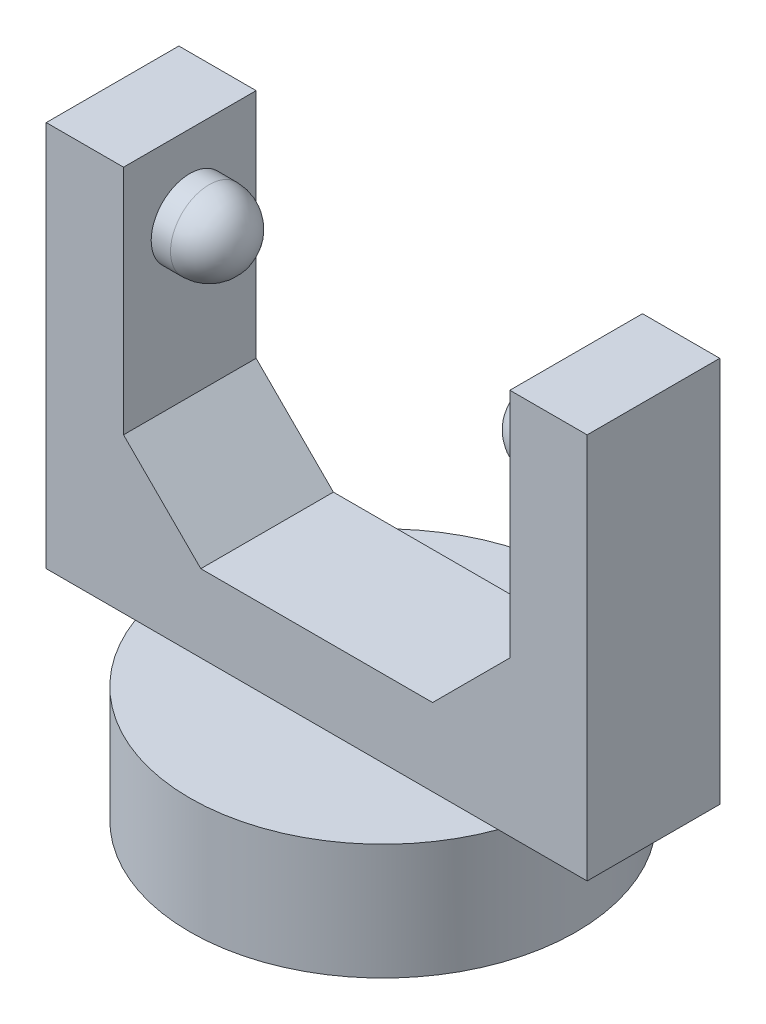
ISO-10303-21;
HEADER;
FILE_DESCRIPTION(('STEP AP214'),'2;1');
FILE_NAME('part.step','',(''),(''),'','','');
FILE_SCHEMA(('AUTOMOTIVE_DESIGN { 1 0 10303 214 1 1 1 1 }'));
ENDSEC;
DATA;
#1=APPLICATION_CONTEXT('core data for automotive mechanical design processes');
#2=APPLICATION_PROTOCOL_DEFINITION('international standard','automotive_design',2000,#1);
#3=PRODUCT_CONTEXT('',#1,'mechanical');
#4=PRODUCT('Part','Part','',(#3));
#5=PRODUCT_RELATED_PRODUCT_CATEGORY('part','',(#4));
#6=PRODUCT_DEFINITION_FORMATION('','',#4);
#7=PRODUCT_DEFINITION_CONTEXT('part definition',#1,'design');
#8=PRODUCT_DEFINITION('design','',#6,#7);
#9=PRODUCT_DEFINITION_SHAPE('','',#8);
#10=(LENGTH_UNIT() NAMED_UNIT(*) SI_UNIT(.MILLI.,.METRE.));
#11=(NAMED_UNIT(*) PLANE_ANGLE_UNIT() SI_UNIT($,.RADIAN.));
#12=(NAMED_UNIT(*) SI_UNIT($,.STERADIAN.) SOLID_ANGLE_UNIT());
#13=UNCERTAINTY_MEASURE_WITH_UNIT(LENGTH_MEASURE(1.E-05),#10,'distance_accuracy_value','');
#14=(GEOMETRIC_REPRESENTATION_CONTEXT(3) GLOBAL_UNCERTAINTY_ASSIGNED_CONTEXT((#13)) GLOBAL_UNIT_ASSIGNED_CONTEXT((#10,
#11,#12)) REPRESENTATION_CONTEXT('',''));
#15=CARTESIAN_POINT('',(0.,0.,0.));
#16=DIRECTION('',(0.,0.,1.));
#17=DIRECTION('',(1.,0.,0.));
#18=AXIS2_PLACEMENT_3D('',#15,#16,#17);
#19=CARTESIAN_POINT('',(0.,32.5,0.));
#20=DIRECTION('',(0.,1.,0.));
#21=DIRECTION('',(0.,0.,1.));
#22=AXIS2_PLACEMENT_3D('',#19,#20,#21);
#23=PLANE('',#22);
#24=DIRECTION('',(0.,0.,1.));
#25=VECTOR('',#24,1.);
#26=CARTESIAN_POINT('',(-12.5,32.5,-4.29038395748194));
#27=LINE('',#26,#25);
#28=CARTESIAN_POINT('',(-12.5,32.5,-4.29038395748194));
#29=VERTEX_POINT('',#28);
#30=CARTESIAN_POINT('',(-12.5,32.5,4.29038395748193));
#31=VERTEX_POINT('',#30);
#32=EDGE_CURVE('E141',#29,#31,#27,.T.);
#33=ORIENTED_EDGE('',*,*,#32,.F.);
#34=DIRECTION('',(-1.,0.,0.));
#35=VECTOR('',#34,1.);
#36=CARTESIAN_POINT('',(-17.5,32.5,-4.29038395748194));
#37=LINE('',#36,#35);
#38=CARTESIAN_POINT('',(-17.5,32.5,-4.29038395748194));
#39=VERTEX_POINT('',#38);
#40=EDGE_CURVE('E159',#29,#39,#37,.T.);
#41=ORIENTED_EDGE('',*,*,#40,.T.);
#42=DIRECTION('',(0.,0.,1.));
#43=VECTOR('',#42,1.);
#44=CARTESIAN_POINT('',(-17.5,32.5,-4.29038395748194));
#45=LINE('',#44,#43);
#46=CARTESIAN_POINT('',(-17.5,32.5,4.29038395748193));
#47=VERTEX_POINT('',#46);
#48=EDGE_CURVE('E151',#39,#47,#45,.T.);
#49=ORIENTED_EDGE('',*,*,#48,.T.);
#50=DIRECTION('',(1.,0.,0.));
#51=VECTOR('',#50,1.);
#52=CARTESIAN_POINT('',(-17.5,32.5,4.29038395748193));
#53=LINE('',#52,#51);
#54=EDGE_CURVE('E131',#47,#31,#53,.T.);
#55=ORIENTED_EDGE('',*,*,#54,.T.);
#56=EDGE_LOOP('',(#33,#41,#49,#55));
#57=FACE_BOUND('',#56,.T.);
#58=ADVANCED_FACE('F38',(#57),#23,.T.);
#59=CARTESIAN_POINT('',(0.,7.5,0.));
#60=DIRECTION('',(0.,1.,0.));
#61=DIRECTION('',(0.,0.,1.));
#62=AXIS2_PLACEMENT_3D('',#59,#60,#61);
#63=PLANE('',#62);
#64=DIRECTION('',(-1.,0.,0.));
#65=VECTOR('',#64,1.);
#66=CARTESIAN_POINT('',(-17.5,7.5,-4.29038395748194));
#67=LINE('',#66,#65);
#68=CARTESIAN_POINT('',(11.7406390583044,7.5,-4.29038395748194));
#69=VERTEX_POINT('',#68);
#70=CARTESIAN_POINT('',(-11.7406390583044,7.5,-4.29038395748194));
#71=VERTEX_POINT('',#70);
#72=EDGE_CURVE('E186',#69,#71,#67,.T.);
#73=ORIENTED_EDGE('',*,*,#72,.F.);
#74=CARTESIAN_POINT('',(0.,7.5,0.));
#75=DIRECTION('',(0.,1.,0.));
#76=DIRECTION('',(0.,0.,1.));
#77=AXIS2_PLACEMENT_3D('',#74,#75,#76);
#78=CIRCLE('',#77,12.5);
#79=EDGE_CURVE('E206',#69,#71,#78,.T.);
#80=ORIENTED_EDGE('',*,*,#79,.T.);
#81=EDGE_LOOP('',(#73,#80));
#82=FACE_BOUND('',#81,.T.);
#83=ADVANCED_FACE('F308',(#82),#63,.T.);
#84=CARTESIAN_POINT('',(0.,7.5,0.));
#85=DIRECTION('',(0.,-1.,0.));
#86=DIRECTION('',(0.,0.,-1.));
#87=AXIS2_PLACEMENT_3D('',#84,#85,#86);
#88=CYLINDRICAL_SURFACE('',#87,12.5);
#89=CARTESIAN_POINT('',(11.7406390583043,7.5,4.29038395748194));
#90=VERTEX_POINT('',#89);
#91=EDGE_CURVE('E202',#90,#69,#78,.T.);
#92=ORIENTED_EDGE('',*,*,#91,.F.);
#93=CARTESIAN_POINT('',(-11.7406390583044,7.5,4.29038395748193));
#94=VERTEX_POINT('',#93);
#95=EDGE_CURVE('E207',#94,#90,#78,.T.);
#96=ORIENTED_EDGE('',*,*,#95,.F.);
#97=EDGE_CURVE('E253',#71,#94,#78,.T.);
#98=ORIENTED_EDGE('',*,*,#97,.F.);
#99=ORIENTED_EDGE('',*,*,#79,.F.);
#100=EDGE_LOOP('',(#92,#96,#98,#99));
#101=FACE_BOUND('',#100,.T.);
#102=CARTESIAN_POINT('',(0.,0.,0.));
#103=DIRECTION('',(0.,1.,0.));
#104=DIRECTION('',(0.,0.,1.));
#105=AXIS2_PLACEMENT_3D('',#102,#103,#104);
#106=CIRCLE('',#105,12.5);
#107=CARTESIAN_POINT('',(0.,0.,12.5));
#108=VERTEX_POINT('',#107);
#109=EDGE_CURVE('E201',#108,#108,#106,.T.);
#110=ORIENTED_EDGE('',*,*,#109,.T.);
#111=EDGE_LOOP('',(#110));
#112=FACE_BOUND('',#111,.T.);
#113=ADVANCED_FACE('F300',(#101,#112),#88,.T.);
#114=DIRECTION('',(1.,0.,0.));
#115=VECTOR('',#114,1.);
#116=CARTESIAN_POINT('',(-17.5,7.5,4.29038395748193));
#117=LINE('',#116,#115);
#118=EDGE_CURVE('E178',#94,#90,#117,.T.);
#119=ORIENTED_EDGE('',*,*,#118,.F.);
#120=ORIENTED_EDGE('',*,*,#95,.T.);
#121=EDGE_LOOP('',(#119,#120));
#122=FACE_BOUND('',#121,.T.);
#123=ADVANCED_FACE('F303',(#122),#63,.T.);
#124=CARTESIAN_POINT('',(0.,0.,0.));
#125=DIRECTION('',(0.,1.,0.));
#126=DIRECTION('',(0.,0.,1.));
#127=AXIS2_PLACEMENT_3D('',#124,#125,#126);
#128=PLANE('',#127);
#129=ORIENTED_EDGE('',*,*,#109,.F.);
#130=EDGE_LOOP('',(#129));
#131=FACE_BOUND('',#130,.T.);
#132=ADVANCED_FACE('F320',(#131),#128,.F.);
#133=CARTESIAN_POINT('',(0.,7.5,0.));
#134=DIRECTION('',(0.,1.,0.));
#135=DIRECTION('',(0.,0.,1.));
#136=AXIS2_PLACEMENT_3D('',#133,#134,#135);
#137=PLANE('',#136);
#138=CARTESIAN_POINT('',(17.5,7.5,4.29038395748194));
#139=VERTEX_POINT('',#138);
#140=EDGE_CURVE('E172',#90,#139,#117,.T.);
#141=ORIENTED_EDGE('',*,*,#140,.F.);
#142=ORIENTED_EDGE('',*,*,#91,.T.);
#143=CARTESIAN_POINT('',(17.5,7.5,-4.29038395748194));
#144=VERTEX_POINT('',#143);
#145=EDGE_CURVE('E182',#144,#69,#67,.T.);
#146=ORIENTED_EDGE('',*,*,#145,.F.);
#147=DIRECTION('',(0.,0.,-1.));
#148=VECTOR('',#147,1.);
#149=CARTESIAN_POINT('',(17.5,7.5,-4.29038395748194));
#150=LINE('',#149,#148);
#151=EDGE_CURVE('E177',#139,#144,#150,.T.);
#152=ORIENTED_EDGE('',*,*,#151,.F.);
#153=EDGE_LOOP('',(#141,#142,#146,#152));
#154=FACE_BOUND('',#153,.T.);
#155=ADVANCED_FACE('F296',(#154),#137,.F.);
#156=CARTESIAN_POINT('',(-17.5,7.5,-4.29038395748194));
#157=VERTEX_POINT('',#156);
#158=EDGE_CURVE('E181',#71,#157,#67,.T.);
#159=ORIENTED_EDGE('',*,*,#158,.F.);
#160=ORIENTED_EDGE('',*,*,#97,.T.);
#161=CARTESIAN_POINT('',(-17.5,7.5,4.29038395748193));
#162=VERTEX_POINT('',#161);
#163=EDGE_CURVE('E173',#162,#94,#117,.T.);
#164=ORIENTED_EDGE('',*,*,#163,.F.);
#165=DIRECTION('',(0.,0.,1.));
#166=VECTOR('',#165,1.);
#167=CARTESIAN_POINT('',(-17.5,7.5,-4.29038395748194));
#168=LINE('',#167,#166);
#169=EDGE_CURVE('E168',#157,#162,#168,.T.);
#170=ORIENTED_EDGE('',*,*,#169,.F.);
#171=EDGE_LOOP('',(#159,#160,#164,#170));
#172=FACE_BOUND('',#171,.T.);
#173=ADVANCED_FACE('F306',(#172),#137,.F.);
#174=CARTESIAN_POINT('',(-17.5,32.5,-4.29038395748194));
#175=DIRECTION('',(1.,0.,0.));
#176=DIRECTION('',(0.,0.,-1.));
#177=AXIS2_PLACEMENT_3D('',#174,#175,#176);
#178=PLANE('',#177);
#179=ORIENTED_EDGE('',*,*,#169,.T.);
#180=DIRECTION('',(0.,-1.,0.));
#181=VECTOR('',#180,1.);
#182=CARTESIAN_POINT('',(-17.5,32.5,4.29038395748193));
#183=LINE('',#182,#181);
#184=EDGE_CURVE('E198',#47,#162,#183,.T.);
#185=ORIENTED_EDGE('',*,*,#184,.F.);
#186=ORIENTED_EDGE('',*,*,#48,.F.);
#187=DIRECTION('',(0.,-1.,0.));
#188=VECTOR('',#187,1.);
#189=CARTESIAN_POINT('',(-17.5,32.5,-4.29038395748194));
#190=LINE('',#189,#188);
#191=EDGE_CURVE('E167',#39,#157,#190,.T.);
#192=ORIENTED_EDGE('',*,*,#191,.T.);
#193=EDGE_LOOP('',(#179,#185,#186,#192));
#194=FACE_BOUND('',#193,.T.);
#195=ADVANCED_FACE('F263',(#194),#178,.F.);
#196=CARTESIAN_POINT('',(-17.5,32.5,4.29038395748193));
#197=DIRECTION('',(0.,0.,-1.));
#198=DIRECTION('',(-1.,0.,0.));
#199=AXIS2_PLACEMENT_3D('',#196,#197,#198);
#200=PLANE('',#199);
#201=DIRECTION('',(1.,0.,0.));
#202=VECTOR('',#201,1.);
#203=CARTESIAN_POINT('',(-12.5,12.5,4.29038395748193));
#204=LINE('',#203,#202);
#205=CARTESIAN_POINT('',(-7.49999999999997,12.5,4.29038395748193));
#206=VERTEX_POINT('',#205);
#207=CARTESIAN_POINT('',(7.49999999999997,12.5,4.29038395748193));
#208=VERTEX_POINT('',#207);
#209=EDGE_CURVE('E276',#206,#208,#204,.T.);
#210=ORIENTED_EDGE('',*,*,#209,.F.);
#211=DIRECTION('',(-0.707106781186551,0.707106781186544,0.));
#212=VECTOR('',#211,1.);
#213=CARTESIAN_POINT('',(-22.5,27.4999999999999,4.29038395748193));
#214=LINE('',#213,#212);
#215=CARTESIAN_POINT('',(-12.5,17.5,4.29038395748193));
#216=VERTEX_POINT('',#215);
#217=EDGE_CURVE('E133',#206,#216,#214,.T.);
#218=ORIENTED_EDGE('',*,*,#217,.T.);
#219=DIRECTION('',(0.,1.,0.));
#220=VECTOR('',#219,1.);
#221=CARTESIAN_POINT('',(-12.5,12.5,4.29038395748193));
#222=LINE('',#221,#220);
#223=EDGE_CURVE('E125',#216,#31,#222,.T.);
#224=ORIENTED_EDGE('',*,*,#223,.T.);
#225=ORIENTED_EDGE('',*,*,#54,.F.);
#226=ORIENTED_EDGE('',*,*,#184,.T.);
#227=ORIENTED_EDGE('',*,*,#163,.T.);
#228=ORIENTED_EDGE('',*,*,#118,.T.);
#229=ORIENTED_EDGE('',*,*,#140,.T.);
#230=DIRECTION('',(0.,-1.,0.));
#231=VECTOR('',#230,1.);
#232=CARTESIAN_POINT('',(17.5,32.5,4.29038395748194));
#233=LINE('',#232,#231);
#234=CARTESIAN_POINT('',(17.5,32.5,4.29038395748194));
#235=VERTEX_POINT('',#234);
#236=EDGE_CURVE('E194',#235,#139,#233,.T.);
#237=ORIENTED_EDGE('',*,*,#236,.F.);
#238=CARTESIAN_POINT('',(12.5,32.5,4.29038395748194));
#239=VERTEX_POINT('',#238);
#240=EDGE_CURVE('E155',#239,#235,#53,.T.);
#241=ORIENTED_EDGE('',*,*,#240,.F.);
#242=DIRECTION('',(0.,1.,0.));
#243=VECTOR('',#242,1.);
#244=CARTESIAN_POINT('',(12.5,12.5,4.29038395748193));
#245=LINE('',#244,#243);
#246=CARTESIAN_POINT('',(12.5,17.5,4.29038395748193));
#247=VERTEX_POINT('',#246);
#248=EDGE_CURVE('E137',#247,#239,#245,.T.);
#249=ORIENTED_EDGE('',*,*,#248,.F.);
#250=DIRECTION('',(-0.707106781186551,-0.707106781186544,0.));
#251=VECTOR('',#250,1.);
#252=CARTESIAN_POINT('',(4.99999999999987,9.99999999999991,4.29038395748193));
#253=LINE('',#252,#251);
#254=EDGE_CURVE('E11',#247,#208,#253,.T.);
#255=ORIENTED_EDGE('',*,*,#254,.T.);
#256=EDGE_LOOP('',(#210,#218,#224,#225,#226,#227,#228,#229,#237,#241,#249,#255));
#257=FACE_BOUND('',#256,.T.);
#258=ADVANCED_FACE('F128',(#257),#200,.F.);
#259=CARTESIAN_POINT('',(17.5,32.5,-4.29038395748194));
#260=DIRECTION('',(-1.,0.,0.));
#261=DIRECTION('',(0.,0.,1.));
#262=AXIS2_PLACEMENT_3D('',#259,#260,#261);
#263=PLANE('',#262);
#264=ORIENTED_EDGE('',*,*,#151,.T.);
#265=DIRECTION('',(0.,-1.,0.));
#266=VECTOR('',#265,1.);
#267=CARTESIAN_POINT('',(17.5,32.5,-4.29038395748194));
#268=LINE('',#267,#266);
#269=CARTESIAN_POINT('',(17.5,32.5,-4.29038395748194));
#270=VERTEX_POINT('',#269);
#271=EDGE_CURVE('E190',#270,#144,#268,.T.);
#272=ORIENTED_EDGE('',*,*,#271,.F.);
#273=DIRECTION('',(0.,0.,-1.));
#274=VECTOR('',#273,1.);
#275=CARTESIAN_POINT('',(17.5,32.5,-4.29038395748194));
#276=LINE('',#275,#274);
#277=EDGE_CURVE('E154',#235,#270,#276,.T.);
#278=ORIENTED_EDGE('',*,*,#277,.F.);
#279=ORIENTED_EDGE('',*,*,#236,.T.);
#280=EDGE_LOOP('',(#264,#272,#278,#279));
#281=FACE_BOUND('',#280,.T.);
#282=ADVANCED_FACE('F352',(#281),#263,.F.);
#283=CARTESIAN_POINT('',(-17.5,32.5,-4.29038395748194));
#284=DIRECTION('',(0.,0.,1.));
#285=DIRECTION('',(1.,0.,0.));
#286=AXIS2_PLACEMENT_3D('',#283,#284,#285);
#287=PLANE('',#286);
#288=ORIENTED_EDGE('',*,*,#40,.F.);
#289=DIRECTION('',(0.,1.,0.));
#290=VECTOR('',#289,1.);
#291=CARTESIAN_POINT('',(-12.5,12.5,-4.29038395748194));
#292=LINE('',#291,#290);
#293=CARTESIAN_POINT('',(-12.5,17.5,-4.29038395748194));
#294=VERTEX_POINT('',#293);
#295=EDGE_CURVE('E144',#294,#29,#292,.T.);
#296=ORIENTED_EDGE('',*,*,#295,.F.);
#297=DIRECTION('',(0.707106781186551,-0.707106781186544,0.));
#298=VECTOR('',#297,1.);
#299=CARTESIAN_POINT('',(-22.5,27.4999999999999,-4.29038395748194));
#300=LINE('',#299,#298);
#301=CARTESIAN_POINT('',(-7.49999999999997,12.5,-4.29038395748194));
#302=VERTEX_POINT('',#301);
#303=EDGE_CURVE('E236',#294,#302,#300,.T.);
#304=ORIENTED_EDGE('',*,*,#303,.T.);
#305=DIRECTION('',(-1.,0.,0.));
#306=VECTOR('',#305,1.);
#307=CARTESIAN_POINT('',(-12.5,12.5,-4.29038395748194));
#308=LINE('',#307,#306);
#309=CARTESIAN_POINT('',(7.49999999999996,12.5,-4.29038395748194));
#310=VERTEX_POINT('',#309);
#311=EDGE_CURVE('E138',#310,#302,#308,.T.);
#312=ORIENTED_EDGE('',*,*,#311,.F.);
#313=DIRECTION('',(0.707106781186551,0.707106781186544,0.));
#314=VECTOR('',#313,1.);
#315=CARTESIAN_POINT('',(4.99999999999987,9.99999999999991,-4.29038395748194));
#316=LINE('',#315,#314);
#317=CARTESIAN_POINT('',(12.5,17.5,-4.29038395748194));
#318=VERTEX_POINT('',#317);
#319=EDGE_CURVE('E47',#310,#318,#316,.T.);
#320=ORIENTED_EDGE('',*,*,#319,.T.);
#321=DIRECTION('',(0.,1.,0.));
#322=VECTOR('',#321,1.);
#323=CARTESIAN_POINT('',(12.5,12.5,-4.29038395748194));
#324=LINE('',#323,#322);
#325=CARTESIAN_POINT('',(12.5,32.5,-4.29038395748194));
#326=VERTEX_POINT('',#325);
#327=EDGE_CURVE('E269',#318,#326,#324,.T.);
#328=ORIENTED_EDGE('',*,*,#327,.T.);
#329=EDGE_CURVE('E163',#270,#326,#37,.T.);
#330=ORIENTED_EDGE('',*,*,#329,.F.);
#331=ORIENTED_EDGE('',*,*,#271,.T.);
#332=ORIENTED_EDGE('',*,*,#145,.T.);
#333=ORIENTED_EDGE('',*,*,#72,.T.);
#334=ORIENTED_EDGE('',*,*,#158,.T.);
#335=ORIENTED_EDGE('',*,*,#191,.F.);
#336=EDGE_LOOP('',(#288,#296,#304,#312,#320,#328,#330,#331,#332,#333,#334,#335));
#337=FACE_BOUND('',#336,.T.);
#338=ADVANCED_FACE('F259',(#337),#287,.F.);
#339=DIRECTION('',(0.,0.,-1.));
#340=VECTOR('',#339,1.);
#341=CARTESIAN_POINT('',(12.5,32.5,-4.29038395748194));
#342=LINE('',#341,#340);
#343=EDGE_CURVE('E148',#239,#326,#342,.T.);
#344=ORIENTED_EDGE('',*,*,#343,.F.);
#345=ORIENTED_EDGE('',*,*,#240,.T.);
#346=ORIENTED_EDGE('',*,*,#277,.T.);
#347=ORIENTED_EDGE('',*,*,#329,.T.);
#348=EDGE_LOOP('',(#344,#345,#346,#347));
#349=FACE_BOUND('',#348,.T.);
#350=ADVANCED_FACE('F288',(#349),#23,.T.);
#351=CARTESIAN_POINT('',(-12.5,12.5,-4.29038395748194));
#352=DIRECTION('',(-1.,0.,0.));
#353=DIRECTION('',(0.,0.,1.));
#354=AXIS2_PLACEMENT_3D('',#351,#352,#353);
#355=PLANE('',#354);
#356=CARTESIAN_POINT('',(-12.5,27.5,0.));
#357=DIRECTION('',(-1.,0.,0.));
#358=DIRECTION('',(0.,0.,1.));
#359=AXIS2_PLACEMENT_3D('',#356,#357,#358);
#360=CIRCLE('',#359,2.5);
#361=CARTESIAN_POINT('',(-12.5,27.5,2.5));
#362=VERTEX_POINT('',#361);
#363=EDGE_CURVE('E211',#362,#362,#360,.F.);
#364=ORIENTED_EDGE('',*,*,#363,.F.);
#365=EDGE_LOOP('',(#364));
#366=FACE_BOUND('',#365,.T.);
#367=ORIENTED_EDGE('',*,*,#223,.F.);
#368=DIRECTION('',(0.,0.,-1.));
#369=VECTOR('',#368,1.);
#370=CARTESIAN_POINT('',(-12.5,17.5,-4.29038395748194));
#371=LINE('',#370,#369);
#372=EDGE_CURVE('E231',#216,#294,#371,.T.);
#373=ORIENTED_EDGE('',*,*,#372,.T.);
#374=ORIENTED_EDGE('',*,*,#295,.T.);
#375=ORIENTED_EDGE('',*,*,#32,.T.);
#376=EDGE_LOOP('',(#367,#373,#374,#375));
#377=FACE_BOUND('',#376,.T.);
#378=ADVANCED_FACE('F142',(#366,#377),#355,.F.);
#379=CARTESIAN_POINT('',(12.5,12.5,-4.29038395748194));
#380=DIRECTION('',(1.,0.,0.));
#381=DIRECTION('',(0.,0.,-1.));
#382=AXIS2_PLACEMENT_3D('',#379,#380,#381);
#383=PLANE('',#382);
#384=CARTESIAN_POINT('',(12.5,27.5,0.));
#385=DIRECTION('',(1.,0.,0.));
#386=DIRECTION('',(0.,0.,-1.));
#387=AXIS2_PLACEMENT_3D('',#384,#385,#386);
#388=CIRCLE('',#387,2.5);
#389=CARTESIAN_POINT('',(12.5,27.5,-2.49999999999999));
#390=VERTEX_POINT('',#389);
#391=EDGE_CURVE('E215',#390,#390,#388,.F.);
#392=ORIENTED_EDGE('',*,*,#391,.F.);
#393=EDGE_LOOP('',(#392));
#394=FACE_BOUND('',#393,.T.);
#395=ORIENTED_EDGE('',*,*,#327,.F.);
#396=DIRECTION('',(0.,0.,1.));
#397=VECTOR('',#396,1.);
#398=CARTESIAN_POINT('',(12.5,17.5,-4.29038395748194));
#399=LINE('',#398,#397);
#400=EDGE_CURVE('E54',#318,#247,#399,.T.);
#401=ORIENTED_EDGE('',*,*,#400,.T.);
#402=ORIENTED_EDGE('',*,*,#248,.T.);
#403=ORIENTED_EDGE('',*,*,#343,.T.);
#404=EDGE_LOOP('',(#395,#401,#402,#403));
#405=FACE_BOUND('',#404,.T.);
#406=ADVANCED_FACE('F284',(#394,#405),#383,.F.);
#407=CARTESIAN_POINT('',(0.,12.5,0.));
#408=DIRECTION('',(0.,1.,0.));
#409=DIRECTION('',(0.,0.,1.));
#410=AXIS2_PLACEMENT_3D('',#407,#408,#409);
#411=PLANE('',#410);
#412=ORIENTED_EDGE('',*,*,#209,.T.);
#413=DIRECTION('',(0.,0.,-1.));
#414=VECTOR('',#413,1.);
#415=CARTESIAN_POINT('',(7.49999999999997,12.5,0.));
#416=LINE('',#415,#414);
#417=EDGE_CURVE('E240',#208,#310,#416,.T.);
#418=ORIENTED_EDGE('',*,*,#417,.T.);
#419=ORIENTED_EDGE('',*,*,#311,.T.);
#420=DIRECTION('',(0.,0.,1.));
#421=VECTOR('',#420,1.);
#422=CARTESIAN_POINT('',(-7.49999999999997,12.5,0.));
#423=LINE('',#422,#421);
#424=EDGE_CURVE('E227',#302,#206,#423,.T.);
#425=ORIENTED_EDGE('',*,*,#424,.T.);
#426=EDGE_LOOP('',(#412,#418,#419,#425));
#427=FACE_BOUND('',#426,.T.);
#428=ADVANCED_FACE('F349',(#427),#411,.T.);
#429=CARTESIAN_POINT('',(-8.75,27.5,0.));
#430=DIRECTION('',(-1.,0.,0.));
#431=DIRECTION('',(0.,0.,1.));
#432=AXIS2_PLACEMENT_3D('',#429,#430,#431);
#433=CYLINDRICAL_SURFACE('',#432,2.5);
#434=CARTESIAN_POINT('',(-11.25,27.5,0.));
#435=DIRECTION('',(-1.,0.,0.));
#436=DIRECTION('',(0.,0.,1.));
#437=AXIS2_PLACEMENT_3D('',#434,#435,#436);
#438=CIRCLE('',#437,2.5);
#439=CARTESIAN_POINT('',(-11.25,27.5,2.5));
#440=VERTEX_POINT('',#439);
#441=EDGE_CURVE('E219',#440,#440,#438,.T.);
#442=ORIENTED_EDGE('',*,*,#441,.T.);
#443=EDGE_LOOP('',(#442));
#444=FACE_BOUND('',#443,.T.);
#445=ORIENTED_EDGE('',*,*,#363,.T.);
#446=EDGE_LOOP('',(#445));
#447=FACE_BOUND('',#446,.T.);
#448=ADVANCED_FACE('F379',(#444,#447),#433,.T.);
#449=CARTESIAN_POINT('',(8.75,27.5,0.));
#450=DIRECTION('',(1.,0.,0.));
#451=DIRECTION('',(0.,0.,-1.));
#452=AXIS2_PLACEMENT_3D('',#449,#450,#451);
#453=CYLINDRICAL_SURFACE('',#452,2.5);
#454=CARTESIAN_POINT('',(11.25,27.5,0.));
#455=DIRECTION('',(1.,0.,0.));
#456=DIRECTION('',(0.,0.,-1.));
#457=AXIS2_PLACEMENT_3D('',#454,#455,#456);
#458=CIRCLE('',#457,2.5);
#459=CARTESIAN_POINT('',(11.25,27.5,-2.5));
#460=VERTEX_POINT('',#459);
#461=EDGE_CURVE('E223',#460,#460,#458,.T.);
#462=ORIENTED_EDGE('',*,*,#461,.T.);
#463=EDGE_LOOP('',(#462));
#464=FACE_BOUND('',#463,.T.);
#465=ORIENTED_EDGE('',*,*,#391,.T.);
#466=EDGE_LOOP('',(#465));
#467=FACE_BOUND('',#466,.T.);
#468=ADVANCED_FACE('F335',(#464,#467),#453,.T.);
#469=CARTESIAN_POINT('',(-11.25,27.5,0.));
#470=DIRECTION('',(1.,0.,0.));
#471=DIRECTION('',(0.,0.,-1.));
#472=AXIS2_PLACEMENT_3D('',#469,#470,#471);
#473=SPHERICAL_SURFACE('',#472,2.5);
#474=ORIENTED_EDGE('',*,*,#441,.F.);
#475=EDGE_LOOP('',(#474));
#476=FACE_BOUND('',#475,.T.);
#477=ADVANCED_FACE('F331',(#476),#473,.T.);
#478=CARTESIAN_POINT('',(11.25,27.5,0.));
#479=DIRECTION('',(-1.,0.,0.));
#480=DIRECTION('',(0.,0.,1.));
#481=AXIS2_PLACEMENT_3D('',#478,#479,#480);
#482=SPHERICAL_SURFACE('',#481,2.5);
#483=ORIENTED_EDGE('',*,*,#461,.F.);
#484=EDGE_LOOP('',(#483));
#485=FACE_BOUND('',#484,.T.);
#486=ADVANCED_FACE('F334',(#485),#482,.T.);
#487=CARTESIAN_POINT('',(-7.49999999999997,12.5,0.));
#488=DIRECTION('',(-0.707106781186544,-0.707106781186551,0.));
#489=DIRECTION('',(0.,0.,1.));
#490=AXIS2_PLACEMENT_3D('',#487,#488,#489);
#491=PLANE('',#490);
#492=ORIENTED_EDGE('',*,*,#303,.F.);
#493=ORIENTED_EDGE('',*,*,#372,.F.);
#494=ORIENTED_EDGE('',*,*,#217,.F.);
#495=ORIENTED_EDGE('',*,*,#424,.F.);
#496=EDGE_LOOP('',(#492,#493,#494,#495));
#497=FACE_BOUND('',#496,.T.);
#498=ADVANCED_FACE('F338',(#497),#491,.F.);
#499=CARTESIAN_POINT('',(7.49999999999997,12.5,0.));
#500=DIRECTION('',(0.707106781186544,-0.707106781186551,0.));
#501=DIRECTION('',(0.,0.,-1.));
#502=AXIS2_PLACEMENT_3D('',#499,#500,#501);
#503=PLANE('',#502);
#504=ORIENTED_EDGE('',*,*,#254,.F.);
#505=ORIENTED_EDGE('',*,*,#400,.F.);
#506=ORIENTED_EDGE('',*,*,#319,.F.);
#507=ORIENTED_EDGE('',*,*,#417,.F.);
#508=EDGE_LOOP('',(#504,#505,#506,#507));
#509=FACE_BOUND('',#508,.T.);
#510=ADVANCED_FACE('F40',(#509),#503,.F.);
#511=CLOSED_SHELL('',(#58,#83,#113,#123,#132,#155,#173,#195,#258,#282,#338,#350,#378,#406,#428,
#448,#468,#477,#486,#498,#510));
#512=MANIFOLD_SOLID_BREP('B2',#511);
#513=ADVANCED_BREP_SHAPE_REPRESENTATION('',(#18,#512),#14);
#514=SHAPE_DEFINITION_REPRESENTATION(#9,#513);
ENDSEC;
END-ISO-10303-21;
